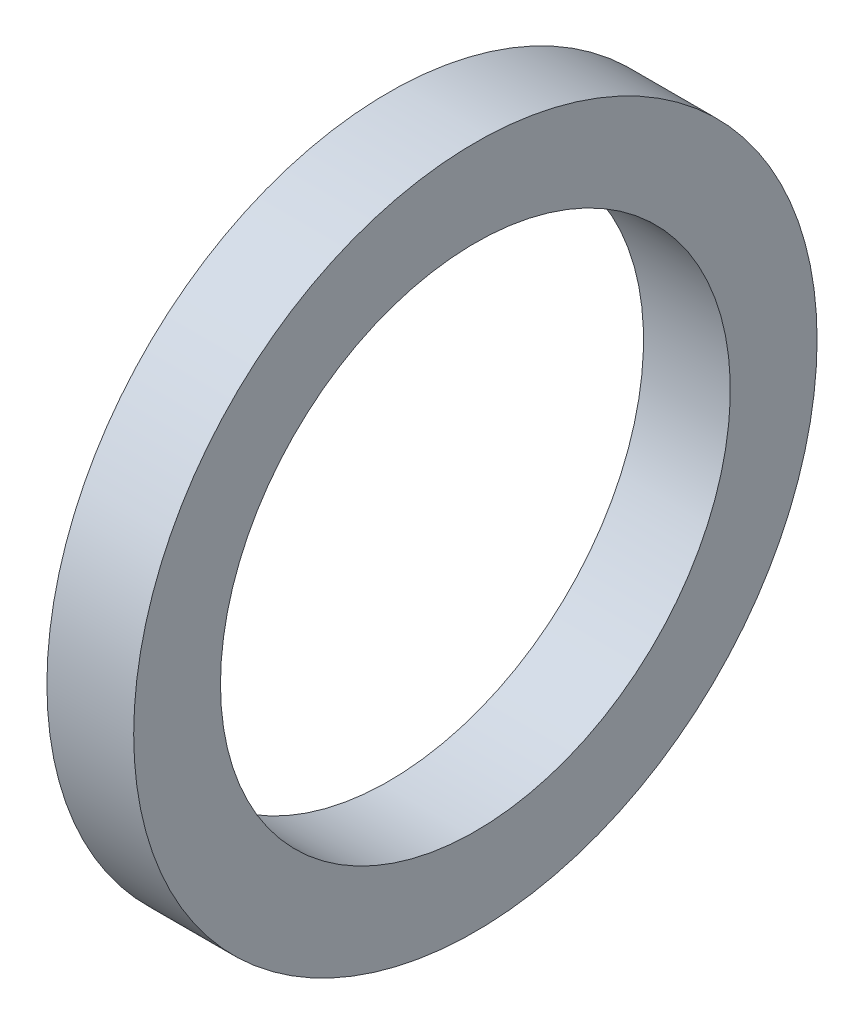
ISO-10303-21;
HEADER;
FILE_DESCRIPTION(('STEP AP214'),'2;1');
FILE_NAME('part.step','',(''),(''),'','','');
FILE_SCHEMA(('AUTOMOTIVE_DESIGN { 1 0 10303 214 1 1 1 1 }'));
ENDSEC;
DATA;
#1=APPLICATION_CONTEXT('core data for automotive mechanical design processes');
#2=APPLICATION_PROTOCOL_DEFINITION('international standard','automotive_design',2000,#1);
#3=PRODUCT_CONTEXT('',#1,'mechanical');
#4=PRODUCT('Part','Part','',(#3));
#5=PRODUCT_RELATED_PRODUCT_CATEGORY('part','',(#4));
#6=PRODUCT_DEFINITION_FORMATION('','',#4);
#7=PRODUCT_DEFINITION_CONTEXT('part definition',#1,'design');
#8=PRODUCT_DEFINITION('design','',#6,#7);
#9=PRODUCT_DEFINITION_SHAPE('','',#8);
#10=(LENGTH_UNIT() NAMED_UNIT(*) SI_UNIT(.MILLI.,.METRE.));
#11=(NAMED_UNIT(*) PLANE_ANGLE_UNIT() SI_UNIT($,.RADIAN.));
#12=(NAMED_UNIT(*) SI_UNIT($,.STERADIAN.) SOLID_ANGLE_UNIT());
#13=UNCERTAINTY_MEASURE_WITH_UNIT(LENGTH_MEASURE(1.E-05),#10,'distance_accuracy_value','');
#14=(GEOMETRIC_REPRESENTATION_CONTEXT(3) GLOBAL_UNCERTAINTY_ASSIGNED_CONTEXT((#13)) GLOBAL_UNIT_ASSIGNED_CONTEXT((#10,
#11,#12)) REPRESENTATION_CONTEXT('',''));
#15=CARTESIAN_POINT('',(0.,0.,0.));
#16=DIRECTION('',(0.,0.,1.));
#17=DIRECTION('',(1.,0.,0.));
#18=AXIS2_PLACEMENT_3D('',#15,#16,#17);
#19=CARTESIAN_POINT('',(0.,-5.969,0.));
#20=DIRECTION('',(-1.,0.,0.));
#21=DIRECTION('',(0.,0.,1.));
#22=AXIS2_PLACEMENT_3D('',#19,#20,#21);
#23=PLANE('',#22);
#24=CARTESIAN_POINT('',(0.,0.,0.));
#25=DIRECTION('',(-1.,0.,0.));
#26=DIRECTION('',(0.,0.,1.));
#27=AXIS2_PLACEMENT_3D('',#24,#25,#26);
#28=CIRCLE('',#27,8.001);
#29=CARTESIAN_POINT('',(0.,0.,8.001));
#30=VERTEX_POINT('',#29);
#31=EDGE_CURVE('E10',#30,#30,#28,.T.);
#32=ORIENTED_EDGE('',*,*,#31,.T.);
#33=EDGE_LOOP('',(#32));
#34=FACE_BOUND('',#33,.T.);
#35=CARTESIAN_POINT('',(0.,0.,0.));
#36=DIRECTION('',(-1.,0.,0.));
#37=DIRECTION('',(0.,0.,1.));
#38=AXIS2_PLACEMENT_3D('',#35,#36,#37);
#39=CIRCLE('',#38,5.969);
#40=CARTESIAN_POINT('',(0.,0.,5.969));
#41=VERTEX_POINT('',#40);
#42=EDGE_CURVE('E43',#41,#41,#39,.T.);
#43=ORIENTED_EDGE('',*,*,#42,.F.);
#44=EDGE_LOOP('',(#43));
#45=FACE_BOUND('',#44,.T.);
#46=ADVANCED_FACE('F29',(#34,#45),#23,.T.);
#47=CARTESIAN_POINT('',(-43.7165807560137,0.,0.));
#48=DIRECTION('',(-1.,0.,0.));
#49=DIRECTION('',(0.,0.,1.));
#50=AXIS2_PLACEMENT_3D('',#47,#48,#49);
#51=CYLINDRICAL_SURFACE('',#50,8.001);
#52=CARTESIAN_POINT('',(2.032,0.,0.));
#53=DIRECTION('',(-1.,0.,0.));
#54=DIRECTION('',(0.,0.,1.));
#55=AXIS2_PLACEMENT_3D('',#52,#53,#54);
#56=CIRCLE('',#55,8.001);
#57=CARTESIAN_POINT('',(2.032,0.,8.001));
#58=VERTEX_POINT('',#57);
#59=EDGE_CURVE('E35',#58,#58,#56,.T.);
#60=ORIENTED_EDGE('',*,*,#59,.T.);
#61=EDGE_LOOP('',(#60));
#62=FACE_BOUND('',#61,.T.);
#63=ORIENTED_EDGE('',*,*,#31,.F.);
#64=EDGE_LOOP('',(#63));
#65=FACE_BOUND('',#64,.T.);
#66=ADVANCED_FACE('F53',(#62,#65),#51,.T.);
#67=CARTESIAN_POINT('',(2.032,-5.969,0.));
#68=DIRECTION('',(1.,0.,0.));
#69=DIRECTION('',(0.,0.,-1.));
#70=AXIS2_PLACEMENT_3D('',#67,#68,#69);
#71=PLANE('',#70);
#72=CARTESIAN_POINT('',(2.032,0.,0.));
#73=DIRECTION('',(-1.,0.,0.));
#74=DIRECTION('',(0.,0.,1.));
#75=AXIS2_PLACEMENT_3D('',#72,#73,#74);
#76=CIRCLE('',#75,5.969);
#77=CARTESIAN_POINT('',(2.032,0.,5.969));
#78=VERTEX_POINT('',#77);
#79=EDGE_CURVE('E39',#78,#78,#76,.T.);
#80=ORIENTED_EDGE('',*,*,#79,.T.);
#81=EDGE_LOOP('',(#80));
#82=FACE_BOUND('',#81,.T.);
#83=ORIENTED_EDGE('',*,*,#59,.F.);
#84=EDGE_LOOP('',(#83));
#85=FACE_BOUND('',#84,.T.);
#86=ADVANCED_FACE('F57',(#82,#85),#71,.T.);
#87=CARTESIAN_POINT('',(-43.7165807560137,0.,0.));
#88=DIRECTION('',(-1.,0.,0.));
#89=DIRECTION('',(0.,0.,1.));
#90=AXIS2_PLACEMENT_3D('',#87,#88,#89);
#91=CYLINDRICAL_SURFACE('',#90,5.969);
#92=ORIENTED_EDGE('',*,*,#42,.T.);
#93=EDGE_LOOP('',(#92));
#94=FACE_BOUND('',#93,.T.);
#95=ORIENTED_EDGE('',*,*,#79,.F.);
#96=EDGE_LOOP('',(#95));
#97=FACE_BOUND('',#96,.T.);
#98=ADVANCED_FACE('F49',(#94,#97),#91,.F.);
#99=CLOSED_SHELL('',(#46,#66,#86,#98));
#100=MANIFOLD_SOLID_BREP('B2',#99);
#101=ADVANCED_BREP_SHAPE_REPRESENTATION('',(#18,#100),#14);
#102=SHAPE_DEFINITION_REPRESENTATION(#9,#101);
ENDSEC;
END-ISO-10303-21;
